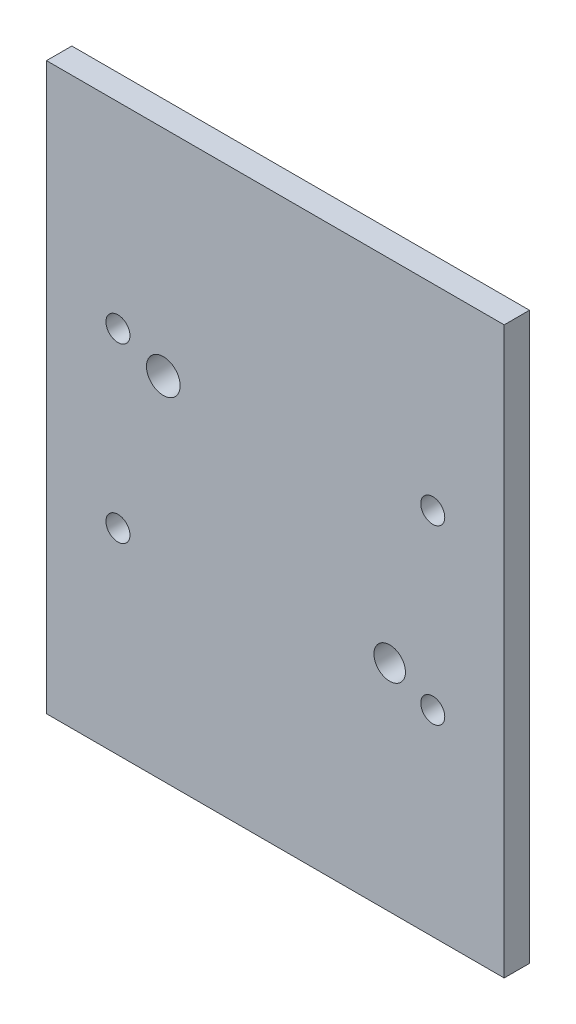
ISO-10303-21;
HEADER;
FILE_DESCRIPTION(('STEP AP214'),'2;1');
FILE_NAME('part.step','',(''),(''),'','','');
FILE_SCHEMA(('AUTOMOTIVE_DESIGN { 1 0 10303 214 1 1 1 1 }'));
ENDSEC;
DATA;
#1=APPLICATION_CONTEXT('core data for automotive mechanical design processes');
#2=APPLICATION_PROTOCOL_DEFINITION('international standard','automotive_design',2000,#1);
#3=PRODUCT_CONTEXT('',#1,'mechanical');
#4=PRODUCT('Part','Part','',(#3));
#5=PRODUCT_RELATED_PRODUCT_CATEGORY('part','',(#4));
#6=PRODUCT_DEFINITION_FORMATION('','',#4);
#7=PRODUCT_DEFINITION_CONTEXT('part definition',#1,'design');
#8=PRODUCT_DEFINITION('design','',#6,#7);
#9=PRODUCT_DEFINITION_SHAPE('','',#8);
#10=(LENGTH_UNIT() NAMED_UNIT(*) SI_UNIT(.MILLI.,.METRE.));
#11=(NAMED_UNIT(*) PLANE_ANGLE_UNIT() SI_UNIT($,.RADIAN.));
#12=(NAMED_UNIT(*) SI_UNIT($,.STERADIAN.) SOLID_ANGLE_UNIT());
#13=UNCERTAINTY_MEASURE_WITH_UNIT(LENGTH_MEASURE(1.E-05),#10,'distance_accuracy_value','');
#14=(GEOMETRIC_REPRESENTATION_CONTEXT(3) GLOBAL_UNCERTAINTY_ASSIGNED_CONTEXT((#13)) GLOBAL_UNIT_ASSIGNED_CONTEXT((#10,
#11,#12)) REPRESENTATION_CONTEXT('',''));
#15=CARTESIAN_POINT('',(0.,0.,0.));
#16=DIRECTION('',(0.,0.,1.));
#17=DIRECTION('',(1.,0.,0.));
#18=AXIS2_PLACEMENT_3D('',#15,#16,#17);
#19=CARTESIAN_POINT('',(21.5265,0.,2.38125));
#20=DIRECTION('',(0.,-1.,0.));
#21=DIRECTION('',(1.,0.,0.));
#22=AXIS2_PLACEMENT_3D('',#19,#20,#21);
#23=PLANE('',#22);
#24=DIRECTION('',(-1.,0.,0.));
#25=VECTOR('',#24,1.);
#26=CARTESIAN_POINT('',(21.5265,0.,0.));
#27=LINE('',#26,#25);
#28=CARTESIAN_POINT('',(21.5265,0.,0.));
#29=VERTEX_POINT('',#28);
#30=CARTESIAN_POINT('',(-21.5265,0.,0.));
#31=VERTEX_POINT('',#30);
#32=EDGE_CURVE('E108',#29,#31,#27,.T.);
#33=ORIENTED_EDGE('',*,*,#32,.T.);
#34=DIRECTION('',(0.,0.,-1.));
#35=VECTOR('',#34,1.);
#36=CARTESIAN_POINT('',(-21.5265,0.,2.38125));
#37=LINE('',#36,#35);
#38=CARTESIAN_POINT('',(-21.5265,0.,2.38125));
#39=VERTEX_POINT('',#38);
#40=EDGE_CURVE('E11',#39,#31,#37,.T.);
#41=ORIENTED_EDGE('',*,*,#40,.F.);
#42=DIRECTION('',(-1.,0.,0.));
#43=VECTOR('',#42,1.);
#44=CARTESIAN_POINT('',(21.5265,0.,2.38125));
#45=LINE('',#44,#43);
#46=CARTESIAN_POINT('',(21.5265,0.,2.38125));
#47=VERTEX_POINT('',#46);
#48=EDGE_CURVE('E90',#47,#39,#45,.T.);
#49=ORIENTED_EDGE('',*,*,#48,.F.);
#50=DIRECTION('',(0.,0.,-1.));
#51=VECTOR('',#50,1.);
#52=CARTESIAN_POINT('',(21.5265,0.,2.38125));
#53=LINE('',#52,#51);
#54=EDGE_CURVE('E57',#47,#29,#53,.T.);
#55=ORIENTED_EDGE('',*,*,#54,.T.);
#56=EDGE_LOOP('',(#33,#41,#49,#55));
#57=FACE_BOUND('',#56,.T.);
#58=ADVANCED_FACE('F40',(#57),#23,.F.);
#59=CARTESIAN_POINT('',(-21.5265,0.,2.38125));
#60=DIRECTION('',(1.,0.,0.));
#61=DIRECTION('',(0.,1.,0.));
#62=AXIS2_PLACEMENT_3D('',#59,#60,#61);
#63=PLANE('',#62);
#64=DIRECTION('',(0.,-1.,0.));
#65=VECTOR('',#64,1.);
#66=CARTESIAN_POINT('',(-21.5265,0.,0.));
#67=LINE('',#66,#65);
#68=CARTESIAN_POINT('',(-21.5265,-53.213,0.));
#69=VERTEX_POINT('',#68);
#70=EDGE_CURVE('E96',#31,#69,#67,.T.);
#71=ORIENTED_EDGE('',*,*,#70,.T.);
#72=DIRECTION('',(0.,0.,-1.));
#73=VECTOR('',#72,1.);
#74=CARTESIAN_POINT('',(-21.5265,-53.213,2.38125));
#75=LINE('',#74,#73);
#76=CARTESIAN_POINT('',(-21.5265,-53.213,2.38125));
#77=VERTEX_POINT('',#76);
#78=EDGE_CURVE('E49',#77,#69,#75,.T.);
#79=ORIENTED_EDGE('',*,*,#78,.F.);
#80=DIRECTION('',(0.,-1.,0.));
#81=VECTOR('',#80,1.);
#82=CARTESIAN_POINT('',(-21.5265,0.,2.38125));
#83=LINE('',#82,#81);
#84=EDGE_CURVE('E82',#39,#77,#83,.T.);
#85=ORIENTED_EDGE('',*,*,#84,.F.);
#86=ORIENTED_EDGE('',*,*,#40,.T.);
#87=EDGE_LOOP('',(#71,#79,#85,#86));
#88=FACE_BOUND('',#87,.T.);
#89=ADVANCED_FACE('F95',(#88),#63,.F.);
#90=CARTESIAN_POINT('',(21.5265,-53.213,2.38125));
#91=DIRECTION('',(0.,-1.,0.));
#92=DIRECTION('',(0.,0.,-1.));
#93=AXIS2_PLACEMENT_3D('',#90,#91,#92);
#94=PLANE('',#93);
#95=DIRECTION('',(-1.,0.,0.));
#96=VECTOR('',#95,1.);
#97=CARTESIAN_POINT('',(21.5265,-53.213,0.));
#98=LINE('',#97,#96);
#99=CARTESIAN_POINT('',(21.5265,-53.213,0.));
#100=VERTEX_POINT('',#99);
#101=EDGE_CURVE('E114',#100,#69,#98,.T.);
#102=ORIENTED_EDGE('',*,*,#101,.F.);
#103=DIRECTION('',(0.,0.,-1.));
#104=VECTOR('',#103,1.);
#105=CARTESIAN_POINT('',(21.5265,-53.213,2.38125));
#106=LINE('',#105,#104);
#107=CARTESIAN_POINT('',(21.5265,-53.213,2.38125));
#108=VERTEX_POINT('',#107);
#109=EDGE_CURVE('E71',#108,#100,#106,.T.);
#110=ORIENTED_EDGE('',*,*,#109,.F.);
#111=DIRECTION('',(-1.,0.,0.));
#112=VECTOR('',#111,1.);
#113=CARTESIAN_POINT('',(21.5265,-53.213,2.38125));
#114=LINE('',#113,#112);
#115=EDGE_CURVE('E89',#108,#77,#114,.T.);
#116=ORIENTED_EDGE('',*,*,#115,.T.);
#117=ORIENTED_EDGE('',*,*,#78,.T.);
#118=EDGE_LOOP('',(#102,#110,#116,#117));
#119=FACE_BOUND('',#118,.T.);
#120=ADVANCED_FACE('F100',(#119),#94,.T.);
#121=CARTESIAN_POINT('',(21.5265,0.,2.38125));
#122=DIRECTION('',(1.,0.,0.));
#123=DIRECTION('',(0.,1.,0.));
#124=AXIS2_PLACEMENT_3D('',#121,#122,#123);
#125=PLANE('',#124);
#126=DIRECTION('',(0.,-1.,0.));
#127=VECTOR('',#126,1.);
#128=CARTESIAN_POINT('',(21.5265,0.,0.));
#129=LINE('',#128,#127);
#130=EDGE_CURVE('E117',#29,#100,#129,.T.);
#131=ORIENTED_EDGE('',*,*,#130,.F.);
#132=ORIENTED_EDGE('',*,*,#54,.F.);
#133=DIRECTION('',(0.,-1.,0.));
#134=VECTOR('',#133,1.);
#135=CARTESIAN_POINT('',(21.5265,0.,2.38125));
#136=LINE('',#135,#134);
#137=EDGE_CURVE('E102',#47,#108,#136,.T.);
#138=ORIENTED_EDGE('',*,*,#137,.T.);
#139=ORIENTED_EDGE('',*,*,#109,.T.);
#140=EDGE_LOOP('',(#131,#132,#138,#139));
#141=FACE_BOUND('',#140,.T.);
#142=ADVANCED_FACE('F187',(#141),#125,.T.);
#143=CARTESIAN_POINT('',(0.,0.,2.38125));
#144=DIRECTION('',(0.,0.,1.));
#145=DIRECTION('',(1.,0.,0.));
#146=AXIS2_PLACEMENT_3D('',#143,#144,#145);
#147=PLANE('',#146);
#148=CARTESIAN_POINT('',(-10.5385523783737,-20.2028657423077,2.38125));
#149=DIRECTION('',(0.,0.,1.));
#150=DIRECTION('',(1.,0.,0.));
#151=AXIS2_PLACEMENT_3D('',#148,#149,#150);
#152=CIRCLE('',#151,1.58322045705789);
#153=CARTESIAN_POINT('',(-8.95533192131579,-20.2028657423077,2.38125));
#154=VERTEX_POINT('',#153);
#155=EDGE_CURVE('E167',#154,#154,#152,.T.);
#156=ORIENTED_EDGE('',*,*,#155,.F.);
#157=EDGE_LOOP('',(#156));
#158=FACE_BOUND('',#157,.T.);
#159=CARTESIAN_POINT('',(10.7581055529231,-32.9369498661759,2.38125));
#160=DIRECTION('',(0.,0.,1.));
#161=DIRECTION('',(1.,0.,0.));
#162=AXIS2_PLACEMENT_3D('',#159,#160,#161);
#163=CIRCLE('',#162,1.48187098502926);
#164=CARTESIAN_POINT('',(12.2399765379524,-32.9369498661759,2.38125));
#165=VERTEX_POINT('',#164);
#166=EDGE_CURVE('E159',#165,#165,#163,.T.);
#167=ORIENTED_EDGE('',*,*,#166,.F.);
#168=EDGE_LOOP('',(#167));
#169=FACE_BOUND('',#168,.T.);
#170=CARTESIAN_POINT('',(-14.8082,-18.4804304,2.38125));
#171=DIRECTION('',(0.,0.,1.));
#172=DIRECTION('',(1.,0.,0.));
#173=AXIS2_PLACEMENT_3D('',#170,#171,#172);
#174=CIRCLE('',#173,1.13029999999999);
#175=CARTESIAN_POINT('',(-13.6779,-18.4804304,2.38125));
#176=VERTEX_POINT('',#175);
#177=EDGE_CURVE('E154',#176,#176,#174,.T.);
#178=ORIENTED_EDGE('',*,*,#177,.F.);
#179=EDGE_LOOP('',(#178));
#180=FACE_BOUND('',#179,.T.);
#181=CARTESIAN_POINT('',(14.8082,-18.4804304,2.38125));
#182=DIRECTION('',(0.,0.,1.));
#183=DIRECTION('',(1.,0.,0.));
#184=AXIS2_PLACEMENT_3D('',#181,#182,#183);
#185=CIRCLE('',#184,1.13029999999999);
#186=CARTESIAN_POINT('',(15.9385,-18.4804304,2.38125));
#187=VERTEX_POINT('',#186);
#188=EDGE_CURVE('E146',#187,#187,#185,.T.);
#189=ORIENTED_EDGE('',*,*,#188,.F.);
#190=EDGE_LOOP('',(#189));
#191=FACE_BOUND('',#190,.T.);
#192=CARTESIAN_POINT('',(-14.8082,-34.7325696,2.38125));
#193=DIRECTION('',(0.,0.,1.));
#194=DIRECTION('',(1.,0.,0.));
#195=AXIS2_PLACEMENT_3D('',#192,#193,#194);
#196=CIRCLE('',#195,1.13029999999999);
#197=CARTESIAN_POINT('',(-13.6779,-34.7325696,2.38125));
#198=VERTEX_POINT('',#197);
#199=EDGE_CURVE('E138',#198,#198,#196,.T.);
#200=ORIENTED_EDGE('',*,*,#199,.F.);
#201=EDGE_LOOP('',(#200));
#202=FACE_BOUND('',#201,.T.);
#203=CARTESIAN_POINT('',(14.8082,-34.7325696,2.38125));
#204=DIRECTION('',(0.,0.,1.));
#205=DIRECTION('',(1.,0.,0.));
#206=AXIS2_PLACEMENT_3D('',#203,#204,#205);
#207=CIRCLE('',#206,1.13029999999999);
#208=CARTESIAN_POINT('',(15.9385,-34.7325696,2.38125));
#209=VERTEX_POINT('',#208);
#210=EDGE_CURVE('E130',#209,#209,#207,.T.);
#211=ORIENTED_EDGE('',*,*,#210,.F.);
#212=EDGE_LOOP('',(#211));
#213=FACE_BOUND('',#212,.T.);
#214=ORIENTED_EDGE('',*,*,#48,.T.);
#215=ORIENTED_EDGE('',*,*,#84,.T.);
#216=ORIENTED_EDGE('',*,*,#115,.F.);
#217=ORIENTED_EDGE('',*,*,#137,.F.);
#218=EDGE_LOOP('',(#214,#215,#216,#217));
#219=FACE_BOUND('',#218,.T.);
#220=ADVANCED_FACE('F86',(#158,#169,#180,#191,#202,#213,#219),#147,.T.);
#221=CARTESIAN_POINT('',(0.,0.,0.));
#222=DIRECTION('',(0.,0.,1.));
#223=DIRECTION('',(1.,0.,0.));
#224=AXIS2_PLACEMENT_3D('',#221,#222,#223);
#225=PLANE('',#224);
#226=CARTESIAN_POINT('',(-10.5385523783737,-20.2028657423077,0.));
#227=DIRECTION('',(0.,0.,1.));
#228=DIRECTION('',(1.,0.,0.));
#229=AXIS2_PLACEMENT_3D('',#226,#227,#228);
#230=CIRCLE('',#229,1.58322045705789);
#231=CARTESIAN_POINT('',(-8.95533192131579,-20.2028657423077,0.));
#232=VERTEX_POINT('',#231);
#233=EDGE_CURVE('E158',#232,#232,#230,.T.);
#234=ORIENTED_EDGE('',*,*,#233,.T.);
#235=EDGE_LOOP('',(#234));
#236=FACE_BOUND('',#235,.T.);
#237=CARTESIAN_POINT('',(10.7581055529231,-32.9369498661759,0.));
#238=DIRECTION('',(0.,0.,1.));
#239=DIRECTION('',(1.,0.,0.));
#240=AXIS2_PLACEMENT_3D('',#237,#238,#239);
#241=CIRCLE('',#240,1.48187098502926);
#242=CARTESIAN_POINT('',(12.2399765379524,-32.9369498661759,0.));
#243=VERTEX_POINT('',#242);
#244=EDGE_CURVE('E163',#243,#243,#241,.T.);
#245=ORIENTED_EDGE('',*,*,#244,.T.);
#246=EDGE_LOOP('',(#245));
#247=FACE_BOUND('',#246,.T.);
#248=CARTESIAN_POINT('',(-14.8082,-18.4804304,0.));
#249=DIRECTION('',(0.,0.,1.));
#250=DIRECTION('',(1.,0.,0.));
#251=AXIS2_PLACEMENT_3D('',#248,#249,#250);
#252=CIRCLE('',#251,1.1303);
#253=CARTESIAN_POINT('',(-13.6779,-18.4804304,0.));
#254=VERTEX_POINT('',#253);
#255=EDGE_CURVE('E150',#254,#254,#252,.T.);
#256=ORIENTED_EDGE('',*,*,#255,.T.);
#257=EDGE_LOOP('',(#256));
#258=FACE_BOUND('',#257,.T.);
#259=CARTESIAN_POINT('',(14.8082,-18.4804304,0.));
#260=DIRECTION('',(0.,0.,1.));
#261=DIRECTION('',(1.,0.,0.));
#262=AXIS2_PLACEMENT_3D('',#259,#260,#261);
#263=CIRCLE('',#262,1.1303);
#264=CARTESIAN_POINT('',(15.9385,-18.4804304,0.));
#265=VERTEX_POINT('',#264);
#266=EDGE_CURVE('E142',#265,#265,#263,.T.);
#267=ORIENTED_EDGE('',*,*,#266,.T.);
#268=EDGE_LOOP('',(#267));
#269=FACE_BOUND('',#268,.T.);
#270=CARTESIAN_POINT('',(-14.8082,-34.7325696,0.));
#271=DIRECTION('',(0.,0.,1.));
#272=DIRECTION('',(1.,0.,0.));
#273=AXIS2_PLACEMENT_3D('',#270,#271,#272);
#274=CIRCLE('',#273,1.1303);
#275=CARTESIAN_POINT('',(-13.6779,-34.7325696,0.));
#276=VERTEX_POINT('',#275);
#277=EDGE_CURVE('E134',#276,#276,#274,.T.);
#278=ORIENTED_EDGE('',*,*,#277,.T.);
#279=EDGE_LOOP('',(#278));
#280=FACE_BOUND('',#279,.T.);
#281=CARTESIAN_POINT('',(14.8082,-34.7325696,0.));
#282=DIRECTION('',(0.,0.,1.));
#283=DIRECTION('',(1.,0.,0.));
#284=AXIS2_PLACEMENT_3D('',#281,#282,#283);
#285=CIRCLE('',#284,1.1303);
#286=CARTESIAN_POINT('',(15.9385,-34.7325696,0.));
#287=VERTEX_POINT('',#286);
#288=EDGE_CURVE('E111',#287,#287,#285,.T.);
#289=ORIENTED_EDGE('',*,*,#288,.T.);
#290=EDGE_LOOP('',(#289));
#291=FACE_BOUND('',#290,.T.);
#292=ORIENTED_EDGE('',*,*,#32,.F.);
#293=ORIENTED_EDGE('',*,*,#130,.T.);
#294=ORIENTED_EDGE('',*,*,#101,.T.);
#295=ORIENTED_EDGE('',*,*,#70,.F.);
#296=EDGE_LOOP('',(#292,#293,#294,#295));
#297=FACE_BOUND('',#296,.T.);
#298=ADVANCED_FACE('F175',(#236,#247,#258,#269,#280,#291,#297),#225,.F.);
#299=CARTESIAN_POINT('',(14.8082,-34.7325696,2.38125));
#300=DIRECTION('',(0.,0.,1.));
#301=DIRECTION('',(1.,0.,0.));
#302=AXIS2_PLACEMENT_3D('',#299,#300,#301);
#303=CYLINDRICAL_SURFACE('',#302,1.13029999999999);
#304=ORIENTED_EDGE('',*,*,#288,.F.);
#305=EDGE_LOOP('',(#304));
#306=FACE_BOUND('',#305,.T.);
#307=ORIENTED_EDGE('',*,*,#210,.T.);
#308=EDGE_LOOP('',(#307));
#309=FACE_BOUND('',#308,.T.);
#310=ADVANCED_FACE('F199',(#306,#309),#303,.F.);
#311=CARTESIAN_POINT('',(-14.8082,-34.7325696,2.38125));
#312=DIRECTION('',(0.,0.,1.));
#313=DIRECTION('',(1.,0.,0.));
#314=AXIS2_PLACEMENT_3D('',#311,#312,#313);
#315=CYLINDRICAL_SURFACE('',#314,1.13029999999999);
#316=ORIENTED_EDGE('',*,*,#277,.F.);
#317=EDGE_LOOP('',(#316));
#318=FACE_BOUND('',#317,.T.);
#319=ORIENTED_EDGE('',*,*,#199,.T.);
#320=EDGE_LOOP('',(#319));
#321=FACE_BOUND('',#320,.T.);
#322=ADVANCED_FACE('F201',(#318,#321),#315,.F.);
#323=CARTESIAN_POINT('',(14.8082,-18.4804304,2.38125));
#324=DIRECTION('',(0.,0.,1.));
#325=DIRECTION('',(1.,0.,0.));
#326=AXIS2_PLACEMENT_3D('',#323,#324,#325);
#327=CYLINDRICAL_SURFACE('',#326,1.13029999999999);
#328=ORIENTED_EDGE('',*,*,#266,.F.);
#329=EDGE_LOOP('',(#328));
#330=FACE_BOUND('',#329,.T.);
#331=ORIENTED_EDGE('',*,*,#188,.T.);
#332=EDGE_LOOP('',(#331));
#333=FACE_BOUND('',#332,.T.);
#334=ADVANCED_FACE('F208',(#330,#333),#327,.F.);
#335=CARTESIAN_POINT('',(-14.8082,-18.4804304,2.38125));
#336=DIRECTION('',(0.,0.,1.));
#337=DIRECTION('',(1.,0.,0.));
#338=AXIS2_PLACEMENT_3D('',#335,#336,#337);
#339=CYLINDRICAL_SURFACE('',#338,1.13029999999999);
#340=ORIENTED_EDGE('',*,*,#255,.F.);
#341=EDGE_LOOP('',(#340));
#342=FACE_BOUND('',#341,.T.);
#343=ORIENTED_EDGE('',*,*,#177,.T.);
#344=EDGE_LOOP('',(#343));
#345=FACE_BOUND('',#344,.T.);
#346=ADVANCED_FACE('F270',(#342,#345),#339,.F.);
#347=CARTESIAN_POINT('',(10.7581055529231,-32.9369498661759,0.));
#348=DIRECTION('',(0.,0.,1.));
#349=DIRECTION('',(1.,0.,0.));
#350=AXIS2_PLACEMENT_3D('',#347,#348,#349);
#351=CYLINDRICAL_SURFACE('',#350,1.48187098502926);
#352=ORIENTED_EDGE('',*,*,#244,.F.);
#353=EDGE_LOOP('',(#352));
#354=FACE_BOUND('',#353,.T.);
#355=ORIENTED_EDGE('',*,*,#166,.T.);
#356=EDGE_LOOP('',(#355));
#357=FACE_BOUND('',#356,.T.);
#358=ADVANCED_FACE('F181',(#354,#357),#351,.F.);
#359=CARTESIAN_POINT('',(-10.5385523783737,-20.2028657423077,0.));
#360=DIRECTION('',(0.,0.,1.));
#361=DIRECTION('',(1.,0.,0.));
#362=AXIS2_PLACEMENT_3D('',#359,#360,#361);
#363=CYLINDRICAL_SURFACE('',#362,1.58322045705789);
#364=ORIENTED_EDGE('',*,*,#233,.F.);
#365=EDGE_LOOP('',(#364));
#366=FACE_BOUND('',#365,.T.);
#367=ORIENTED_EDGE('',*,*,#155,.T.);
#368=EDGE_LOOP('',(#367));
#369=FACE_BOUND('',#368,.T.);
#370=ADVANCED_FACE('F178',(#366,#369),#363,.F.);
#371=CLOSED_SHELL('',(#58,#89,#120,#142,#220,#298,#310,#322,#334,#346,#358,#370));
#372=MANIFOLD_SOLID_BREP('B2',#371);
#373=ADVANCED_BREP_SHAPE_REPRESENTATION('',(#18,#372),#14);
#374=SHAPE_DEFINITION_REPRESENTATION(#9,#373);
ENDSEC;
END-ISO-10303-21;
